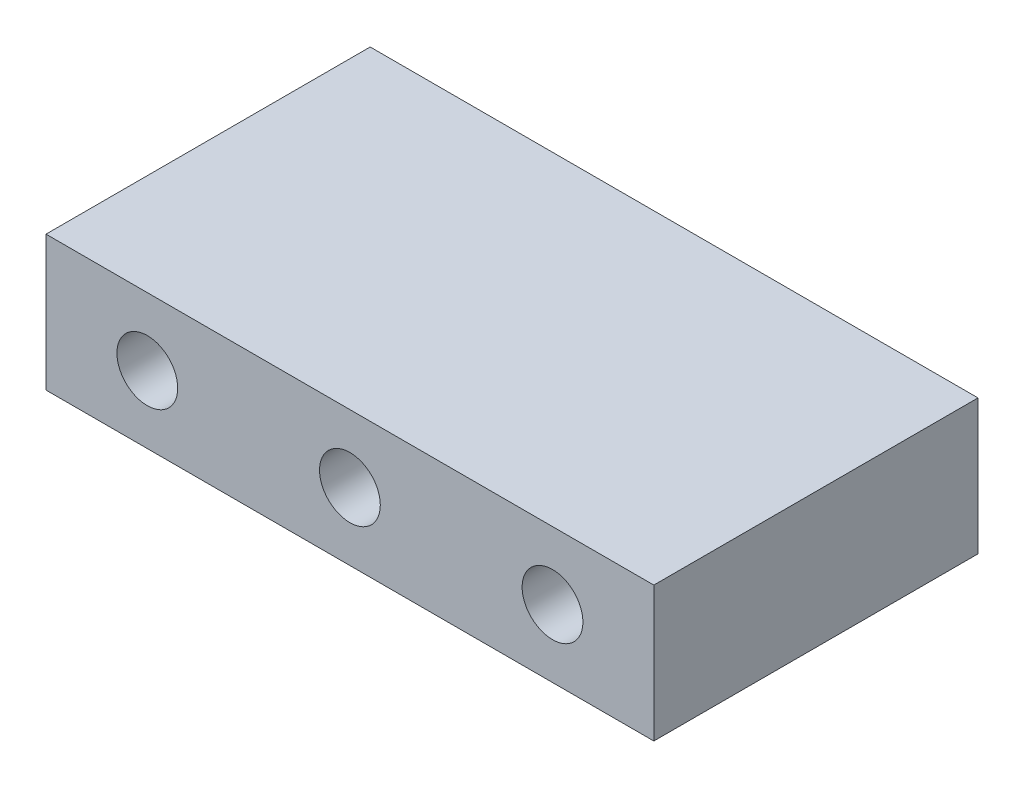
ISO-10303-21;
HEADER;
FILE_DESCRIPTION(('STEP AP214'),'2;1');
FILE_NAME('part.step','',(''),(''),'','','');
FILE_SCHEMA(('AUTOMOTIVE_DESIGN { 1 0 10303 214 1 1 1 1 }'));
ENDSEC;
DATA;
#1=APPLICATION_CONTEXT('core data for automotive mechanical design processes');
#2=APPLICATION_PROTOCOL_DEFINITION('international standard','automotive_design',2000,#1);
#3=PRODUCT_CONTEXT('',#1,'mechanical');
#4=PRODUCT('Part','Part','',(#3));
#5=PRODUCT_RELATED_PRODUCT_CATEGORY('part','',(#4));
#6=PRODUCT_DEFINITION_FORMATION('','',#4);
#7=PRODUCT_DEFINITION_CONTEXT('part definition',#1,'design');
#8=PRODUCT_DEFINITION('design','',#6,#7);
#9=PRODUCT_DEFINITION_SHAPE('','',#8);
#10=(LENGTH_UNIT() NAMED_UNIT(*) SI_UNIT(.MILLI.,.METRE.));
#11=(NAMED_UNIT(*) PLANE_ANGLE_UNIT() SI_UNIT($,.RADIAN.));
#12=(NAMED_UNIT(*) SI_UNIT($,.STERADIAN.) SOLID_ANGLE_UNIT());
#13=UNCERTAINTY_MEASURE_WITH_UNIT(LENGTH_MEASURE(1.E-05),#10,'distance_accuracy_value','');
#14=(GEOMETRIC_REPRESENTATION_CONTEXT(3) GLOBAL_UNCERTAINTY_ASSIGNED_CONTEXT((#13)) GLOBAL_UNIT_ASSIGNED_CONTEXT((#10,
#11,#12)) REPRESENTATION_CONTEXT('',''));
#15=CARTESIAN_POINT('',(0.,0.,0.));
#16=DIRECTION('',(0.,0.,1.));
#17=DIRECTION('',(1.,0.,0.));
#18=AXIS2_PLACEMENT_3D('',#15,#16,#17);
#19=CARTESIAN_POINT('',(0.,0.,48.));
#20=DIRECTION('',(0.,0.,1.));
#21=DIRECTION('',(1.,0.,0.));
#22=AXIS2_PLACEMENT_3D('',#19,#20,#21);
#23=PLANE('',#22);
#24=CARTESIAN_POINT('',(0.,0.,48.));
#25=DIRECTION('',(0.,0.,1.));
#26=DIRECTION('',(1.,0.,0.));
#27=AXIS2_PLACEMENT_3D('',#24,#25,#26);
#28=CIRCLE('',#27,4.5);
#29=CARTESIAN_POINT('',(4.49999999999999,0.,48.));
#30=VERTEX_POINT('',#29);
#31=EDGE_CURVE('E118',#30,#30,#28,.T.);
#32=ORIENTED_EDGE('',*,*,#31,.F.);
#33=EDGE_LOOP('',(#32));
#34=FACE_BOUND('',#33,.T.);
#35=DIRECTION('',(0.,1.,0.));
#36=VECTOR('',#35,1.);
#37=CARTESIAN_POINT('',(45.,10.,48.));
#38=LINE('',#37,#36);
#39=CARTESIAN_POINT('',(45.,-10.,48.));
#40=VERTEX_POINT('',#39);
#41=CARTESIAN_POINT('',(45.,10.,48.));
#42=VERTEX_POINT('',#41);
#43=EDGE_CURVE('E88',#40,#42,#38,.T.);
#44=ORIENTED_EDGE('',*,*,#43,.T.);
#45=DIRECTION('',(-1.,0.,0.));
#46=VECTOR('',#45,1.);
#47=CARTESIAN_POINT('',(-45.,10.,48.));
#48=LINE('',#47,#46);
#49=CARTESIAN_POINT('',(-45.,10.,48.));
#50=VERTEX_POINT('',#49);
#51=EDGE_CURVE('E83',#42,#50,#48,.T.);
#52=ORIENTED_EDGE('',*,*,#51,.T.);
#53=DIRECTION('',(0.,-1.,0.));
#54=VECTOR('',#53,1.);
#55=CARTESIAN_POINT('',(-45.,10.,48.));
#56=LINE('',#55,#54);
#57=CARTESIAN_POINT('',(-45.,-10.,48.));
#58=VERTEX_POINT('',#57);
#59=EDGE_CURVE('E86',#50,#58,#56,.T.);
#60=ORIENTED_EDGE('',*,*,#59,.T.);
#61=DIRECTION('',(1.,0.,0.));
#62=VECTOR('',#61,1.);
#63=CARTESIAN_POINT('',(-45.,-10.,48.));
#64=LINE('',#63,#62);
#65=EDGE_CURVE('E53',#58,#40,#64,.T.);
#66=ORIENTED_EDGE('',*,*,#65,.T.);
#67=EDGE_LOOP('',(#44,#52,#60,#66));
#68=FACE_BOUND('',#67,.T.);
#69=CARTESIAN_POINT('',(-30.,0.,48.));
#70=DIRECTION('',(0.,0.,1.));
#71=DIRECTION('',(1.,0.,0.));
#72=AXIS2_PLACEMENT_3D('',#69,#70,#71);
#73=CIRCLE('',#72,4.5);
#74=CARTESIAN_POINT('',(-25.5,0.,48.));
#75=VERTEX_POINT('',#74);
#76=EDGE_CURVE('E103',#75,#75,#73,.T.);
#77=ORIENTED_EDGE('',*,*,#76,.F.);
#78=EDGE_LOOP('',(#77));
#79=FACE_BOUND('',#78,.T.);
#80=CARTESIAN_POINT('',(30.,0.,48.));
#81=DIRECTION('',(0.,0.,1.));
#82=DIRECTION('',(1.,0.,0.));
#83=AXIS2_PLACEMENT_3D('',#80,#81,#82);
#84=CIRCLE('',#83,4.5);
#85=CARTESIAN_POINT('',(34.5,0.,48.));
#86=VERTEX_POINT('',#85);
#87=EDGE_CURVE('E124',#86,#86,#84,.T.);
#88=ORIENTED_EDGE('',*,*,#87,.F.);
#89=EDGE_LOOP('',(#88));
#90=FACE_BOUND('',#89,.T.);
#91=ADVANCED_FACE('F36',(#34,#68,#79,#90),#23,.T.);
#92=CARTESIAN_POINT('',(0.,0.,0.));
#93=DIRECTION('',(0.,0.,1.));
#94=DIRECTION('',(1.,0.,0.));
#95=AXIS2_PLACEMENT_3D('',#92,#93,#94);
#96=PLANE('',#95);
#97=DIRECTION('',(0.,1.,0.));
#98=VECTOR('',#97,1.);
#99=CARTESIAN_POINT('',(45.,10.,0.));
#100=LINE('',#99,#98);
#101=CARTESIAN_POINT('',(45.,-10.,0.));
#102=VERTEX_POINT('',#101);
#103=CARTESIAN_POINT('',(45.,10.,0.));
#104=VERTEX_POINT('',#103);
#105=EDGE_CURVE('E100',#102,#104,#100,.T.);
#106=ORIENTED_EDGE('',*,*,#105,.F.);
#107=DIRECTION('',(1.,0.,0.));
#108=VECTOR('',#107,1.);
#109=CARTESIAN_POINT('',(-45.,-10.,0.));
#110=LINE('',#109,#108);
#111=CARTESIAN_POINT('',(-45.,-10.,0.));
#112=VERTEX_POINT('',#111);
#113=EDGE_CURVE('E76',#112,#102,#110,.T.);
#114=ORIENTED_EDGE('',*,*,#113,.F.);
#115=DIRECTION('',(0.,-1.,0.));
#116=VECTOR('',#115,1.);
#117=CARTESIAN_POINT('',(-45.,10.,0.));
#118=LINE('',#117,#116);
#119=CARTESIAN_POINT('',(-45.,10.,0.));
#120=VERTEX_POINT('',#119);
#121=EDGE_CURVE('E70',#120,#112,#118,.T.);
#122=ORIENTED_EDGE('',*,*,#121,.F.);
#123=DIRECTION('',(-1.,0.,0.));
#124=VECTOR('',#123,1.);
#125=CARTESIAN_POINT('',(-45.,10.,0.));
#126=LINE('',#125,#124);
#127=EDGE_CURVE('E92',#104,#120,#126,.T.);
#128=ORIENTED_EDGE('',*,*,#127,.F.);
#129=EDGE_LOOP('',(#106,#114,#122,#128));
#130=FACE_BOUND('',#129,.T.);
#131=CARTESIAN_POINT('',(-30.,0.,0.));
#132=DIRECTION('',(0.,0.,1.));
#133=DIRECTION('',(1.,0.,0.));
#134=AXIS2_PLACEMENT_3D('',#131,#132,#133);
#135=CIRCLE('',#134,4.5);
#136=CARTESIAN_POINT('',(-25.5,0.,0.));
#137=VERTEX_POINT('',#136);
#138=EDGE_CURVE('E115',#137,#137,#135,.T.);
#139=ORIENTED_EDGE('',*,*,#138,.T.);
#140=EDGE_LOOP('',(#139));
#141=FACE_BOUND('',#140,.T.);
#142=CARTESIAN_POINT('',(0.,0.,0.));
#143=DIRECTION('',(0.,0.,1.));
#144=DIRECTION('',(1.,0.,0.));
#145=AXIS2_PLACEMENT_3D('',#142,#143,#144);
#146=CIRCLE('',#145,4.5);
#147=CARTESIAN_POINT('',(4.49999999999999,0.,0.));
#148=VERTEX_POINT('',#147);
#149=EDGE_CURVE('E121',#148,#148,#146,.T.);
#150=ORIENTED_EDGE('',*,*,#149,.T.);
#151=EDGE_LOOP('',(#150));
#152=FACE_BOUND('',#151,.T.);
#153=CARTESIAN_POINT('',(30.,0.,0.));
#154=DIRECTION('',(0.,0.,1.));
#155=DIRECTION('',(1.,0.,0.));
#156=AXIS2_PLACEMENT_3D('',#153,#154,#155);
#157=CIRCLE('',#156,4.5);
#158=CARTESIAN_POINT('',(34.5,0.,0.));
#159=VERTEX_POINT('',#158);
#160=EDGE_CURVE('E127',#159,#159,#157,.T.);
#161=ORIENTED_EDGE('',*,*,#160,.T.);
#162=EDGE_LOOP('',(#161));
#163=FACE_BOUND('',#162,.T.);
#164=ADVANCED_FACE('F111',(#130,#141,#152,#163),#96,.F.);
#165=CARTESIAN_POINT('',(45.,10.,48.));
#166=DIRECTION('',(-1.,0.,0.));
#167=DIRECTION('',(0.,0.,1.));
#168=AXIS2_PLACEMENT_3D('',#165,#166,#167);
#169=PLANE('',#168);
#170=ORIENTED_EDGE('',*,*,#105,.T.);
#171=DIRECTION('',(0.,0.,-1.));
#172=VECTOR('',#171,1.);
#173=CARTESIAN_POINT('',(45.,10.,48.));
#174=LINE('',#173,#172);
#175=EDGE_CURVE('E11',#42,#104,#174,.T.);
#176=ORIENTED_EDGE('',*,*,#175,.F.);
#177=ORIENTED_EDGE('',*,*,#43,.F.);
#178=DIRECTION('',(0.,0.,-1.));
#179=VECTOR('',#178,1.);
#180=CARTESIAN_POINT('',(45.,-10.,48.));
#181=LINE('',#180,#179);
#182=EDGE_CURVE('E96',#40,#102,#181,.T.);
#183=ORIENTED_EDGE('',*,*,#182,.T.);
#184=EDGE_LOOP('',(#170,#176,#177,#183));
#185=FACE_BOUND('',#184,.T.);
#186=ADVANCED_FACE('F38',(#185),#169,.F.);
#187=CARTESIAN_POINT('',(-45.,10.,48.));
#188=DIRECTION('',(0.,-1.,0.));
#189=DIRECTION('',(1.,0.,0.));
#190=AXIS2_PLACEMENT_3D('',#187,#188,#189);
#191=PLANE('',#190);
#192=ORIENTED_EDGE('',*,*,#127,.T.);
#193=DIRECTION('',(0.,0.,-1.));
#194=VECTOR('',#193,1.);
#195=CARTESIAN_POINT('',(-45.,10.,48.));
#196=LINE('',#195,#194);
#197=EDGE_CURVE('E45',#50,#120,#196,.T.);
#198=ORIENTED_EDGE('',*,*,#197,.F.);
#199=ORIENTED_EDGE('',*,*,#51,.F.);
#200=ORIENTED_EDGE('',*,*,#175,.T.);
#201=EDGE_LOOP('',(#192,#198,#199,#200));
#202=FACE_BOUND('',#201,.T.);
#203=ADVANCED_FACE('F91',(#202),#191,.F.);
#204=CARTESIAN_POINT('',(-45.,10.,48.));
#205=DIRECTION('',(1.,0.,0.));
#206=DIRECTION('',(0.,0.,-1.));
#207=AXIS2_PLACEMENT_3D('',#204,#205,#206);
#208=PLANE('',#207);
#209=ORIENTED_EDGE('',*,*,#121,.T.);
#210=DIRECTION('',(0.,0.,-1.));
#211=VECTOR('',#210,1.);
#212=CARTESIAN_POINT('',(-45.,-10.,48.));
#213=LINE('',#212,#211);
#214=EDGE_CURVE('E93',#58,#112,#213,.T.);
#215=ORIENTED_EDGE('',*,*,#214,.F.);
#216=ORIENTED_EDGE('',*,*,#59,.F.);
#217=ORIENTED_EDGE('',*,*,#197,.T.);
#218=EDGE_LOOP('',(#209,#215,#216,#217));
#219=FACE_BOUND('',#218,.T.);
#220=ADVANCED_FACE('F94',(#219),#208,.F.);
#221=CARTESIAN_POINT('',(-45.,-10.,48.));
#222=DIRECTION('',(0.,1.,0.));
#223=DIRECTION('',(0.,0.,1.));
#224=AXIS2_PLACEMENT_3D('',#221,#222,#223);
#225=PLANE('',#224);
#226=ORIENTED_EDGE('',*,*,#113,.T.);
#227=ORIENTED_EDGE('',*,*,#182,.F.);
#228=ORIENTED_EDGE('',*,*,#65,.F.);
#229=ORIENTED_EDGE('',*,*,#214,.T.);
#230=EDGE_LOOP('',(#226,#227,#228,#229));
#231=FACE_BOUND('',#230,.T.);
#232=ADVANCED_FACE('F108',(#231),#225,.F.);
#233=CARTESIAN_POINT('',(-30.,0.,48.));
#234=DIRECTION('',(0.,0.,-1.));
#235=DIRECTION('',(-1.,0.,0.));
#236=AXIS2_PLACEMENT_3D('',#233,#234,#235);
#237=CYLINDRICAL_SURFACE('',#236,4.5);
#238=ORIENTED_EDGE('',*,*,#76,.T.);
#239=EDGE_LOOP('',(#238));
#240=FACE_BOUND('',#239,.T.);
#241=ORIENTED_EDGE('',*,*,#138,.F.);
#242=EDGE_LOOP('',(#241));
#243=FACE_BOUND('',#242,.T.);
#244=ADVANCED_FACE('F145',(#240,#243),#237,.F.);
#245=CARTESIAN_POINT('',(0.,0.,48.));
#246=DIRECTION('',(0.,0.,-1.));
#247=DIRECTION('',(-1.,0.,0.));
#248=AXIS2_PLACEMENT_3D('',#245,#246,#247);
#249=CYLINDRICAL_SURFACE('',#248,4.5);
#250=ORIENTED_EDGE('',*,*,#31,.T.);
#251=EDGE_LOOP('',(#250));
#252=FACE_BOUND('',#251,.T.);
#253=ORIENTED_EDGE('',*,*,#149,.F.);
#254=EDGE_LOOP('',(#253));
#255=FACE_BOUND('',#254,.T.);
#256=ADVANCED_FACE('F199',(#252,#255),#249,.F.);
#257=CARTESIAN_POINT('',(30.,0.,48.));
#258=DIRECTION('',(0.,0.,-1.));
#259=DIRECTION('',(-1.,0.,0.));
#260=AXIS2_PLACEMENT_3D('',#257,#258,#259);
#261=CYLINDRICAL_SURFACE('',#260,4.5);
#262=ORIENTED_EDGE('',*,*,#87,.T.);
#263=EDGE_LOOP('',(#262));
#264=FACE_BOUND('',#263,.T.);
#265=ORIENTED_EDGE('',*,*,#160,.F.);
#266=EDGE_LOOP('',(#265));
#267=FACE_BOUND('',#266,.T.);
#268=ADVANCED_FACE('F133',(#264,#267),#261,.F.);
#269=CLOSED_SHELL('',(#91,#164,#186,#203,#220,#232,#244,#256,#268));
#270=MANIFOLD_SOLID_BREP('B2',#269);
#271=ADVANCED_BREP_SHAPE_REPRESENTATION('',(#18,#270),#14);
#272=SHAPE_DEFINITION_REPRESENTATION(#9,#271);
ENDSEC;
END-ISO-10303-21;
